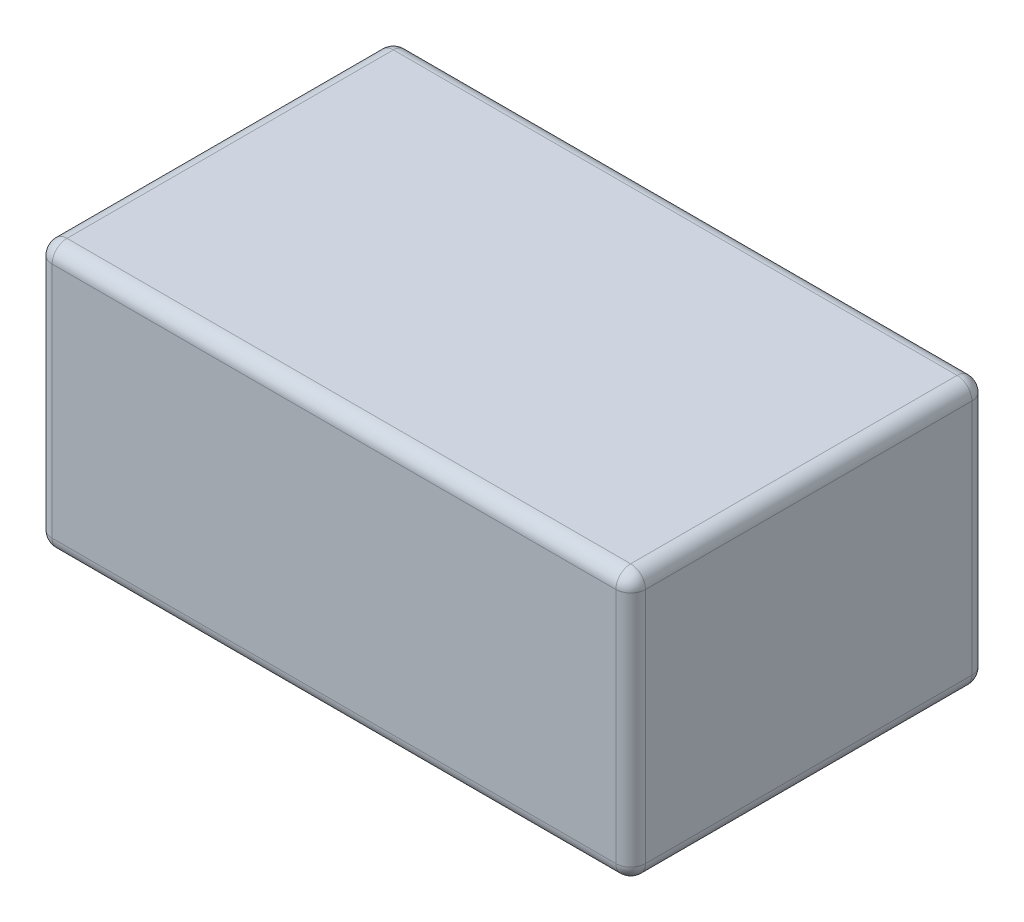
ISO-10303-21;
HEADER;
FILE_DESCRIPTION(('STEP AP214'),'2;1');
FILE_NAME('part.step','',(''),(''),'','','');
FILE_SCHEMA(('AUTOMOTIVE_DESIGN { 1 0 10303 214 1 1 1 1 }'));
ENDSEC;
DATA;
#1=APPLICATION_CONTEXT('core data for automotive mechanical design processes');
#2=APPLICATION_PROTOCOL_DEFINITION('international standard','automotive_design',2000,#1);
#3=PRODUCT_CONTEXT('',#1,'mechanical');
#4=PRODUCT('Part','Part','',(#3));
#5=PRODUCT_RELATED_PRODUCT_CATEGORY('part','',(#4));
#6=PRODUCT_DEFINITION_FORMATION('','',#4);
#7=PRODUCT_DEFINITION_CONTEXT('part definition',#1,'design');
#8=PRODUCT_DEFINITION('design','',#6,#7);
#9=PRODUCT_DEFINITION_SHAPE('','',#8);
#10=(LENGTH_UNIT() NAMED_UNIT(*) SI_UNIT(.MILLI.,.METRE.));
#11=(NAMED_UNIT(*) PLANE_ANGLE_UNIT() SI_UNIT($,.RADIAN.));
#12=(NAMED_UNIT(*) SI_UNIT($,.STERADIAN.) SOLID_ANGLE_UNIT());
#13=UNCERTAINTY_MEASURE_WITH_UNIT(LENGTH_MEASURE(1.E-05),#10,'distance_accuracy_value','');
#14=(GEOMETRIC_REPRESENTATION_CONTEXT(3) GLOBAL_UNCERTAINTY_ASSIGNED_CONTEXT((#13)) GLOBAL_UNIT_ASSIGNED_CONTEXT((#10,
#11,#12)) REPRESENTATION_CONTEXT('',''));
#15=CARTESIAN_POINT('',(0.,0.,0.));
#16=DIRECTION('',(0.,0.,1.));
#17=DIRECTION('',(1.,0.,0.));
#18=AXIS2_PLACEMENT_3D('',#15,#16,#17);
#19=CARTESIAN_POINT('',(0.95,0.05,0.55));
#20=DIRECTION('',(1.,0.,0.));
#21=DIRECTION('',(0.,0.,-1.));
#22=AXIS2_PLACEMENT_3D('',#19,#20,#21);
#23=SPHERICAL_SURFACE('',#22,0.05);
#24=CARTESIAN_POINT('',(0.95,0.05,0.55));
#25=DIRECTION('',(-1.,0.,0.));
#26=DIRECTION('',(0.,0.,1.));
#27=AXIS2_PLACEMENT_3D('',#24,#25,#26);
#28=CIRCLE('',#27,0.05);
#29=CARTESIAN_POINT('',(0.95,0.,0.55));
#30=VERTEX_POINT('',#29);
#31=CARTESIAN_POINT('',(0.95,0.050000000000024,0.6));
#32=VERTEX_POINT('',#31);
#33=EDGE_CURVE('E111',#30,#32,#28,.T.);
#34=ORIENTED_EDGE('',*,*,#33,.F.);
#35=CARTESIAN_POINT('',(0.95,0.05,0.55));
#36=DIRECTION('',(0.,0.,1.));
#37=DIRECTION('',(1.,0.,0.));
#38=AXIS2_PLACEMENT_3D('',#35,#36,#37);
#39=CIRCLE('',#38,0.05);
#40=CARTESIAN_POINT('',(1.,0.05,0.55));
#41=VERTEX_POINT('',#40);
#42=EDGE_CURVE('E122',#41,#30,#39,.F.);
#43=ORIENTED_EDGE('',*,*,#42,.F.);
#44=CARTESIAN_POINT('',(0.95,0.05,0.55));
#45=DIRECTION('',(0.,-1.,0.));
#46=DIRECTION('',(0.,0.,-1.));
#47=AXIS2_PLACEMENT_3D('',#44,#45,#46);
#48=CIRCLE('',#47,0.05);
#49=EDGE_CURVE('E131',#32,#41,#48,.F.);
#50=ORIENTED_EDGE('',*,*,#49,.F.);
#51=EDGE_LOOP('',(#34,#43,#50));
#52=FACE_BOUND('',#51,.T.);
#53=ADVANCED_FACE('F17',(#52),#23,.T.);
#54=CARTESIAN_POINT('',(-0.95,0.05,0.55));
#55=DIRECTION('',(1.,0.,0.));
#56=DIRECTION('',(0.,0.,-1.));
#57=AXIS2_PLACEMENT_3D('',#54,#55,#56);
#58=SPHERICAL_SURFACE('',#57,0.05);
#59=CARTESIAN_POINT('',(-0.95,0.05,0.55));
#60=DIRECTION('',(0.,-1.,0.));
#61=DIRECTION('',(0.,0.,-1.));
#62=AXIS2_PLACEMENT_3D('',#59,#60,#61);
#63=CIRCLE('',#62,0.05);
#64=CARTESIAN_POINT('',(-1.,0.05,0.55));
#65=VERTEX_POINT('',#64);
#66=CARTESIAN_POINT('',(-0.95,0.05,0.6));
#67=VERTEX_POINT('',#66);
#68=EDGE_CURVE('E261',#65,#67,#63,.F.);
#69=ORIENTED_EDGE('',*,*,#68,.F.);
#70=CARTESIAN_POINT('',(-0.95,0.05,0.55));
#71=DIRECTION('',(0.,0.,-1.));
#72=DIRECTION('',(-1.,0.,0.));
#73=AXIS2_PLACEMENT_3D('',#70,#71,#72);
#74=CIRCLE('',#73,0.05);
#75=CARTESIAN_POINT('',(-0.95,0.,0.549999999999904));
#76=VERTEX_POINT('',#75);
#77=EDGE_CURVE('E270',#76,#65,#74,.T.);
#78=ORIENTED_EDGE('',*,*,#77,.F.);
#79=CARTESIAN_POINT('',(-0.95,0.05,0.55));
#80=DIRECTION('',(-1.,0.,0.));
#81=DIRECTION('',(0.,0.,1.));
#82=AXIS2_PLACEMENT_3D('',#79,#80,#81);
#83=CIRCLE('',#82,0.05);
#84=EDGE_CURVE('E114',#67,#76,#83,.F.);
#85=ORIENTED_EDGE('',*,*,#84,.F.);
#86=EDGE_LOOP('',(#69,#78,#85));
#87=FACE_BOUND('',#86,.T.);
#88=ADVANCED_FACE('F151',(#87),#58,.T.);
#89=CARTESIAN_POINT('',(-0.95,0.05,-0.55));
#90=DIRECTION('',(1.,0.,0.));
#91=DIRECTION('',(0.,0.,-1.));
#92=AXIS2_PLACEMENT_3D('',#89,#90,#91);
#93=SPHERICAL_SURFACE('',#92,0.05);
#94=CARTESIAN_POINT('',(-0.95,0.05,-0.55));
#95=DIRECTION('',(0.,-1.,0.));
#96=DIRECTION('',(0.,0.,-1.));
#97=AXIS2_PLACEMENT_3D('',#94,#95,#96);
#98=CIRCLE('',#97,0.05);
#99=CARTESIAN_POINT('',(-0.95,0.05,-0.6));
#100=VERTEX_POINT('',#99);
#101=CARTESIAN_POINT('',(-1.,0.05,-0.55));
#102=VERTEX_POINT('',#101);
#103=EDGE_CURVE('E256',#100,#102,#98,.F.);
#104=ORIENTED_EDGE('',*,*,#103,.F.);
#105=CARTESIAN_POINT('',(-0.95,0.05,-0.55));
#106=DIRECTION('',(1.,0.,0.));
#107=DIRECTION('',(0.,0.,-1.));
#108=AXIS2_PLACEMENT_3D('',#105,#106,#107);
#109=CIRCLE('',#108,0.05);
#110=CARTESIAN_POINT('',(-0.95,0.,-0.55));
#111=VERTEX_POINT('',#110);
#112=EDGE_CURVE('E253',#111,#100,#109,.T.);
#113=ORIENTED_EDGE('',*,*,#112,.F.);
#114=CARTESIAN_POINT('',(-0.95,0.05,-0.55));
#115=DIRECTION('',(0.,0.,-1.));
#116=DIRECTION('',(-1.,0.,0.));
#117=AXIS2_PLACEMENT_3D('',#114,#115,#116);
#118=CIRCLE('',#117,0.05);
#119=EDGE_CURVE('E267',#102,#111,#118,.F.);
#120=ORIENTED_EDGE('',*,*,#119,.F.);
#121=EDGE_LOOP('',(#104,#113,#120));
#122=FACE_BOUND('',#121,.T.);
#123=ADVANCED_FACE('F147',(#122),#93,.T.);
#124=CARTESIAN_POINT('',(0.95,0.05,-0.55));
#125=DIRECTION('',(1.,0.,0.));
#126=DIRECTION('',(0.,0.,-1.));
#127=AXIS2_PLACEMENT_3D('',#124,#125,#126);
#128=SPHERICAL_SURFACE('',#127,0.05);
#129=CARTESIAN_POINT('',(0.95,0.05,-0.55));
#130=DIRECTION('',(1.,0.,0.));
#131=DIRECTION('',(0.,0.,-1.));
#132=AXIS2_PLACEMENT_3D('',#129,#130,#131);
#133=CIRCLE('',#132,0.05);
#134=CARTESIAN_POINT('',(0.95,0.05,-0.6));
#135=VERTEX_POINT('',#134);
#136=CARTESIAN_POINT('',(0.95,0.,-0.549999999999952));
#137=VERTEX_POINT('',#136);
#138=EDGE_CURVE('E251',#135,#137,#133,.F.);
#139=ORIENTED_EDGE('',*,*,#138,.F.);
#140=CARTESIAN_POINT('',(0.95,0.05,-0.55));
#141=DIRECTION('',(0.,-1.,0.));
#142=DIRECTION('',(0.,0.,-1.));
#143=AXIS2_PLACEMENT_3D('',#140,#141,#142);
#144=CIRCLE('',#143,0.05);
#145=CARTESIAN_POINT('',(1.,0.05,-0.55));
#146=VERTEX_POINT('',#145);
#147=EDGE_CURVE('E258',#146,#135,#144,.F.);
#148=ORIENTED_EDGE('',*,*,#147,.F.);
#149=CARTESIAN_POINT('',(0.95,0.05,-0.55));
#150=DIRECTION('',(0.,0.,1.));
#151=DIRECTION('',(1.,0.,0.));
#152=AXIS2_PLACEMENT_3D('',#149,#150,#151);
#153=CIRCLE('',#152,0.05);
#154=EDGE_CURVE('E133',#137,#146,#153,.T.);
#155=ORIENTED_EDGE('',*,*,#154,.F.);
#156=EDGE_LOOP('',(#139,#148,#155));
#157=FACE_BOUND('',#156,.T.);
#158=ADVANCED_FACE('F143',(#157),#128,.T.);
#159=CARTESIAN_POINT('',(0.95,0.05,0.6));
#160=DIRECTION('',(0.,0.,1.));
#161=DIRECTION('',(1.,0.,0.));
#162=AXIS2_PLACEMENT_3D('',#159,#160,#161);
#163=CYLINDRICAL_SURFACE('',#162,0.05);
#164=ORIENTED_EDGE('',*,*,#154,.T.);
#165=DIRECTION('',(0.,0.,1.));
#166=VECTOR('',#165,1.);
#167=CARTESIAN_POINT('',(1.,0.05,0.6));
#168=LINE('',#167,#166);
#169=EDGE_CURVE('E127',#146,#41,#168,.T.);
#170=ORIENTED_EDGE('',*,*,#169,.T.);
#171=ORIENTED_EDGE('',*,*,#42,.T.);
#172=DIRECTION('',(0.,0.,1.));
#173=VECTOR('',#172,1.);
#174=CARTESIAN_POINT('',(0.95,0.,0.6));
#175=LINE('',#174,#173);
#176=EDGE_CURVE('E124',#30,#137,#175,.F.);
#177=ORIENTED_EDGE('',*,*,#176,.T.);
#178=EDGE_LOOP('',(#164,#170,#171,#177));
#179=FACE_BOUND('',#178,.T.);
#180=ADVANCED_FACE('F123',(#179),#163,.T.);
#181=CARTESIAN_POINT('',(0.95,0.9,0.55));
#182=DIRECTION('',(0.,-1.,0.));
#183=DIRECTION('',(0.,0.,-1.));
#184=AXIS2_PLACEMENT_3D('',#181,#182,#183);
#185=CYLINDRICAL_SURFACE('',#184,0.05);
#186=ORIENTED_EDGE('',*,*,#49,.T.);
#187=DIRECTION('',(0.,1.,0.));
#188=VECTOR('',#187,1.);
#189=CARTESIAN_POINT('',(1.,0.9,0.55));
#190=LINE('',#189,#188);
#191=CARTESIAN_POINT('',(1.,0.85,0.55));
#192=VERTEX_POINT('',#191);
#193=EDGE_CURVE('E247',#41,#192,#190,.T.);
#194=ORIENTED_EDGE('',*,*,#193,.T.);
#195=CARTESIAN_POINT('',(0.95,0.85,0.55));
#196=DIRECTION('',(0.,-1.,0.));
#197=DIRECTION('',(1.,0.,0.));
#198=AXIS2_PLACEMENT_3D('',#195,#196,#197);
#199=CIRCLE('',#198,0.05);
#200=CARTESIAN_POINT('',(0.95,0.85,0.6));
#201=VERTEX_POINT('',#200);
#202=EDGE_CURVE('E242',#201,#192,#199,.F.);
#203=ORIENTED_EDGE('',*,*,#202,.F.);
#204=DIRECTION('',(0.,1.,0.));
#205=VECTOR('',#204,1.);
#206=CARTESIAN_POINT('',(0.95,0.9,0.6));
#207=LINE('',#206,#205);
#208=EDGE_CURVE('E116',#201,#32,#207,.F.);
#209=ORIENTED_EDGE('',*,*,#208,.T.);
#210=EDGE_LOOP('',(#186,#194,#203,#209));
#211=FACE_BOUND('',#210,.T.);
#212=ADVANCED_FACE('F274',(#211),#185,.T.);
#213=CARTESIAN_POINT('',(-0.95,0.05,0.6));
#214=DIRECTION('',(0.,0.,-1.));
#215=DIRECTION('',(-1.,0.,0.));
#216=AXIS2_PLACEMENT_3D('',#213,#214,#215);
#217=CYLINDRICAL_SURFACE('',#216,0.05);
#218=ORIENTED_EDGE('',*,*,#119,.T.);
#219=DIRECTION('',(0.,0.,-1.));
#220=VECTOR('',#219,1.);
#221=CARTESIAN_POINT('',(-0.95,0.,0.6));
#222=LINE('',#221,#220);
#223=EDGE_CURVE('E264',#111,#76,#222,.F.);
#224=ORIENTED_EDGE('',*,*,#223,.T.);
#225=ORIENTED_EDGE('',*,*,#77,.T.);
#226=DIRECTION('',(0.,0.,-1.));
#227=VECTOR('',#226,1.);
#228=CARTESIAN_POINT('',(-1.,0.05,0.6));
#229=LINE('',#228,#227);
#230=EDGE_CURVE('E220',#65,#102,#229,.T.);
#231=ORIENTED_EDGE('',*,*,#230,.T.);
#232=EDGE_LOOP('',(#218,#224,#225,#231));
#233=FACE_BOUND('',#232,.T.);
#234=ADVANCED_FACE('F361',(#233),#217,.T.);
#235=CARTESIAN_POINT('',(-0.95,0.9,0.55));
#236=DIRECTION('',(0.,-1.,0.));
#237=DIRECTION('',(0.,0.,-1.));
#238=AXIS2_PLACEMENT_3D('',#235,#236,#237);
#239=CYLINDRICAL_SURFACE('',#238,0.05);
#240=ORIENTED_EDGE('',*,*,#68,.T.);
#241=DIRECTION('',(0.,1.,0.));
#242=VECTOR('',#241,1.);
#243=CARTESIAN_POINT('',(-0.95,0.9,0.6));
#244=LINE('',#243,#242);
#245=CARTESIAN_POINT('',(-0.95,0.849999999999952,0.6));
#246=VERTEX_POINT('',#245);
#247=EDGE_CURVE('E241',#67,#246,#244,.T.);
#248=ORIENTED_EDGE('',*,*,#247,.T.);
#249=CARTESIAN_POINT('',(-0.95,0.85,0.55));
#250=DIRECTION('',(0.,-1.,-7.66574547575187E-12));
#251=DIRECTION('',(1.,0.,0.));
#252=AXIS2_PLACEMENT_3D('',#249,#250,#251);
#253=CIRCLE('',#252,0.05);
#254=CARTESIAN_POINT('',(-1.,0.85,0.55));
#255=VERTEX_POINT('',#254);
#256=EDGE_CURVE('E223',#255,#246,#253,.F.);
#257=ORIENTED_EDGE('',*,*,#256,.F.);
#258=DIRECTION('',(0.,1.,0.));
#259=VECTOR('',#258,1.);
#260=CARTESIAN_POINT('',(-1.,0.9,0.55));
#261=LINE('',#260,#259);
#262=EDGE_CURVE('E214',#255,#65,#261,.F.);
#263=ORIENTED_EDGE('',*,*,#262,.T.);
#264=EDGE_LOOP('',(#240,#248,#257,#263));
#265=FACE_BOUND('',#264,.T.);
#266=ADVANCED_FACE('F359',(#265),#239,.T.);
#267=CARTESIAN_POINT('',(0.95,0.9,-0.55));
#268=DIRECTION('',(0.,-1.,0.));
#269=DIRECTION('',(0.,0.,-1.));
#270=AXIS2_PLACEMENT_3D('',#267,#268,#269);
#271=CYLINDRICAL_SURFACE('',#270,0.05);
#272=ORIENTED_EDGE('',*,*,#147,.T.);
#273=DIRECTION('',(0.,1.,0.));
#274=VECTOR('',#273,1.);
#275=CARTESIAN_POINT('',(0.95,0.9,-0.6));
#276=LINE('',#275,#274);
#277=CARTESIAN_POINT('',(0.95,0.85,-0.6));
#278=VERTEX_POINT('',#277);
#279=EDGE_CURVE('E206',#135,#278,#276,.T.);
#280=ORIENTED_EDGE('',*,*,#279,.T.);
#281=CARTESIAN_POINT('',(0.95,0.85,-0.55));
#282=DIRECTION('',(0.,1.,0.));
#283=DIRECTION('',(1.,0.,0.));
#284=AXIS2_PLACEMENT_3D('',#281,#282,#283);
#285=CIRCLE('',#284,0.05);
#286=CARTESIAN_POINT('',(1.,0.85,-0.55));
#287=VERTEX_POINT('',#286);
#288=EDGE_CURVE('E208',#287,#278,#285,.T.);
#289=ORIENTED_EDGE('',*,*,#288,.F.);
#290=DIRECTION('',(0.,1.,0.));
#291=VECTOR('',#290,1.);
#292=CARTESIAN_POINT('',(1.,0.9,-0.55));
#293=LINE('',#292,#291);
#294=EDGE_CURVE('E117',#287,#146,#293,.F.);
#295=ORIENTED_EDGE('',*,*,#294,.T.);
#296=EDGE_LOOP('',(#272,#280,#289,#295));
#297=FACE_BOUND('',#296,.T.);
#298=ADVANCED_FACE('F310',(#297),#271,.T.);
#299=CARTESIAN_POINT('',(-0.95,0.9,-0.55));
#300=DIRECTION('',(0.,-1.,0.));
#301=DIRECTION('',(0.,0.,-1.));
#302=AXIS2_PLACEMENT_3D('',#299,#300,#301);
#303=CYLINDRICAL_SURFACE('',#302,0.05);
#304=CARTESIAN_POINT('',(-0.95,0.85,-0.55));
#305=DIRECTION('',(0.,1.,0.));
#306=DIRECTION('',(1.,0.,0.));
#307=AXIS2_PLACEMENT_3D('',#304,#305,#306);
#308=CIRCLE('',#307,0.05);
#309=CARTESIAN_POINT('',(-0.95,0.85,-0.6));
#310=VERTEX_POINT('',#309);
#311=CARTESIAN_POINT('',(-1.,0.85,-0.55));
#312=VERTEX_POINT('',#311);
#313=EDGE_CURVE('E210',#310,#312,#308,.T.);
#314=ORIENTED_EDGE('',*,*,#313,.F.);
#315=DIRECTION('',(0.,1.,0.));
#316=VECTOR('',#315,1.);
#317=CARTESIAN_POINT('',(-0.95,0.9,-0.6));
#318=LINE('',#317,#316);
#319=EDGE_CURVE('E300',#310,#100,#318,.F.);
#320=ORIENTED_EDGE('',*,*,#319,.T.);
#321=ORIENTED_EDGE('',*,*,#103,.T.);
#322=DIRECTION('',(0.,1.,0.));
#323=VECTOR('',#322,1.);
#324=CARTESIAN_POINT('',(-1.,0.9,-0.55));
#325=LINE('',#324,#323);
#326=EDGE_CURVE('E217',#102,#312,#325,.T.);
#327=ORIENTED_EDGE('',*,*,#326,.T.);
#328=EDGE_LOOP('',(#314,#320,#321,#327));
#329=FACE_BOUND('',#328,.T.);
#330=ADVANCED_FACE('F351',(#329),#303,.T.);
#331=CARTESIAN_POINT('',(1.,0.,-0.6));
#332=DIRECTION('',(0.,-1.,0.));
#333=DIRECTION('',(0.,0.,-1.));
#334=AXIS2_PLACEMENT_3D('',#331,#332,#333);
#335=PLANE('',#334);
#336=DIRECTION('',(1.,0.,0.));
#337=VECTOR('',#336,1.);
#338=CARTESIAN_POINT('',(-1.,0.,-0.55));
#339=LINE('',#338,#337);
#340=EDGE_CURVE('E101',#137,#111,#339,.F.);
#341=ORIENTED_EDGE('',*,*,#340,.F.);
#342=ORIENTED_EDGE('',*,*,#176,.F.);
#343=DIRECTION('',(-1.,0.,0.));
#344=VECTOR('',#343,1.);
#345=CARTESIAN_POINT('',(-1.,0.,0.55));
#346=LINE('',#345,#344);
#347=EDGE_CURVE('E107',#76,#30,#346,.F.);
#348=ORIENTED_EDGE('',*,*,#347,.F.);
#349=ORIENTED_EDGE('',*,*,#223,.F.);
#350=EDGE_LOOP('',(#341,#342,#348,#349));
#351=FACE_BOUND('',#350,.T.);
#352=ADVANCED_FACE('F135',(#351),#335,.T.);
#353=CARTESIAN_POINT('',(1.,0.9,0.6));
#354=DIRECTION('',(-1.,0.,0.));
#355=DIRECTION('',(0.,0.,1.));
#356=AXIS2_PLACEMENT_3D('',#353,#354,#355);
#357=PLANE('',#356);
#358=DIRECTION('',(0.,0.,-1.));
#359=VECTOR('',#358,1.);
#360=CARTESIAN_POINT('',(1.,0.85,-0.6));
#361=LINE('',#360,#359);
#362=EDGE_CURVE('E291',#192,#287,#361,.T.);
#363=ORIENTED_EDGE('',*,*,#362,.F.);
#364=ORIENTED_EDGE('',*,*,#193,.F.);
#365=ORIENTED_EDGE('',*,*,#169,.F.);
#366=ORIENTED_EDGE('',*,*,#294,.F.);
#367=EDGE_LOOP('',(#363,#364,#365,#366));
#368=FACE_BOUND('',#367,.T.);
#369=ADVANCED_FACE('F346',(#368),#357,.F.);
#370=CARTESIAN_POINT('',(-1.,0.05,0.55));
#371=DIRECTION('',(-1.,0.,0.));
#372=DIRECTION('',(0.,0.,1.));
#373=AXIS2_PLACEMENT_3D('',#370,#371,#372);
#374=CYLINDRICAL_SURFACE('',#373,0.05);
#375=ORIENTED_EDGE('',*,*,#347,.T.);
#376=ORIENTED_EDGE('',*,*,#33,.T.);
#377=DIRECTION('',(-1.,0.,0.));
#378=VECTOR('',#377,1.);
#379=CARTESIAN_POINT('',(-1.,0.05,0.6));
#380=LINE('',#379,#378);
#381=EDGE_CURVE('E282',#32,#67,#380,.T.);
#382=ORIENTED_EDGE('',*,*,#381,.T.);
#383=ORIENTED_EDGE('',*,*,#84,.T.);
#384=EDGE_LOOP('',(#375,#376,#382,#383));
#385=FACE_BOUND('',#384,.T.);
#386=ADVANCED_FACE('F109',(#385),#374,.T.);
#387=CARTESIAN_POINT('',(0.95,0.85,0.55));
#388=DIRECTION('',(1.,0.,0.));
#389=DIRECTION('',(0.,0.,-1.));
#390=AXIS2_PLACEMENT_3D('',#387,#388,#389);
#391=SPHERICAL_SURFACE('',#390,0.05);
#392=ORIENTED_EDGE('',*,*,#202,.T.);
#393=CARTESIAN_POINT('',(0.95,0.85,0.55));
#394=DIRECTION('',(0.,0.,-1.));
#395=DIRECTION('',(-1.,0.,0.));
#396=AXIS2_PLACEMENT_3D('',#393,#394,#395);
#397=CIRCLE('',#396,0.05);
#398=CARTESIAN_POINT('',(0.95,0.9,0.549999999999808));
#399=VERTEX_POINT('',#398);
#400=EDGE_CURVE('E297',#399,#192,#397,.T.);
#401=ORIENTED_EDGE('',*,*,#400,.F.);
#402=CARTESIAN_POINT('',(0.95,0.85,0.55));
#403=DIRECTION('',(1.,0.,0.));
#404=DIRECTION('',(0.,0.,-1.));
#405=AXIS2_PLACEMENT_3D('',#402,#403,#404);
#406=CIRCLE('',#405,0.05);
#407=EDGE_CURVE('E284',#201,#399,#406,.F.);
#408=ORIENTED_EDGE('',*,*,#407,.F.);
#409=EDGE_LOOP('',(#392,#401,#408));
#410=FACE_BOUND('',#409,.T.);
#411=ADVANCED_FACE('F232',(#410),#391,.T.);
#412=CARTESIAN_POINT('',(-0.95,0.85,0.55));
#413=DIRECTION('',(1.,0.,0.));
#414=DIRECTION('',(0.,0.,-1.));
#415=AXIS2_PLACEMENT_3D('',#412,#413,#414);
#416=SPHERICAL_SURFACE('',#415,0.05);
#417=ORIENTED_EDGE('',*,*,#256,.T.);
#418=CARTESIAN_POINT('',(-0.95,0.85,0.55));
#419=DIRECTION('',(1.,0.,0.));
#420=DIRECTION('',(0.,0.,-1.));
#421=AXIS2_PLACEMENT_3D('',#418,#419,#420);
#422=CIRCLE('',#421,0.05);
#423=CARTESIAN_POINT('',(-0.95,0.9,0.55));
#424=VERTEX_POINT('',#423);
#425=EDGE_CURVE('E288',#424,#246,#422,.T.);
#426=ORIENTED_EDGE('',*,*,#425,.F.);
#427=CARTESIAN_POINT('',(-0.95,0.85,0.55));
#428=DIRECTION('',(0.,0.,1.));
#429=DIRECTION('',(1.,0.,0.));
#430=AXIS2_PLACEMENT_3D('',#427,#428,#429);
#431=CIRCLE('',#430,0.05);
#432=EDGE_CURVE('E331',#255,#424,#431,.F.);
#433=ORIENTED_EDGE('',*,*,#432,.F.);
#434=EDGE_LOOP('',(#417,#426,#433));
#435=FACE_BOUND('',#434,.T.);
#436=ADVANCED_FACE('F228',(#435),#416,.T.);
#437=CARTESIAN_POINT('',(-1.,0.9,0.6));
#438=DIRECTION('',(1.,0.,0.));
#439=DIRECTION('',(0.,0.,-1.));
#440=AXIS2_PLACEMENT_3D('',#437,#438,#439);
#441=PLANE('',#440);
#442=DIRECTION('',(0.,0.,1.));
#443=VECTOR('',#442,1.);
#444=CARTESIAN_POINT('',(-1.,0.85,-0.6));
#445=LINE('',#444,#443);
#446=EDGE_CURVE('E322',#312,#255,#445,.T.);
#447=ORIENTED_EDGE('',*,*,#446,.F.);
#448=ORIENTED_EDGE('',*,*,#326,.F.);
#449=ORIENTED_EDGE('',*,*,#230,.F.);
#450=ORIENTED_EDGE('',*,*,#262,.F.);
#451=EDGE_LOOP('',(#447,#448,#449,#450));
#452=FACE_BOUND('',#451,.T.);
#453=ADVANCED_FACE('F231',(#452),#441,.F.);
#454=CARTESIAN_POINT('',(-0.95,0.85,-0.55));
#455=DIRECTION('',(1.,0.,0.));
#456=DIRECTION('',(0.,0.,-1.));
#457=AXIS2_PLACEMENT_3D('',#454,#455,#456);
#458=SPHERICAL_SURFACE('',#457,0.05);
#459=CARTESIAN_POINT('',(-0.95,0.85,-0.55));
#460=DIRECTION('',(0.,0.,1.));
#461=DIRECTION('',(1.,0.,0.));
#462=AXIS2_PLACEMENT_3D('',#459,#460,#461);
#463=CIRCLE('',#462,0.05);
#464=CARTESIAN_POINT('',(-0.95,0.9,-0.549999999999808));
#465=VERTEX_POINT('',#464);
#466=EDGE_CURVE('E328',#465,#312,#463,.T.);
#467=ORIENTED_EDGE('',*,*,#466,.F.);
#468=CARTESIAN_POINT('',(-0.95,0.85,-0.55));
#469=DIRECTION('',(-1.,0.,0.));
#470=DIRECTION('',(0.,0.,1.));
#471=AXIS2_PLACEMENT_3D('',#468,#469,#470);
#472=CIRCLE('',#471,0.05);
#473=EDGE_CURVE('E318',#310,#465,#472,.F.);
#474=ORIENTED_EDGE('',*,*,#473,.F.);
#475=ORIENTED_EDGE('',*,*,#313,.T.);
#476=EDGE_LOOP('',(#467,#474,#475));
#477=FACE_BOUND('',#476,.T.);
#478=ADVANCED_FACE('F199',(#477),#458,.T.);
#479=CARTESIAN_POINT('',(0.95,0.85,-0.55));
#480=DIRECTION('',(1.,0.,0.));
#481=DIRECTION('',(0.,0.,-1.));
#482=AXIS2_PLACEMENT_3D('',#479,#480,#481);
#483=SPHERICAL_SURFACE('',#482,0.05);
#484=CARTESIAN_POINT('',(0.95,0.85,-0.55));
#485=DIRECTION('',(0.,0.,-1.));
#486=DIRECTION('',(-1.,0.,0.));
#487=AXIS2_PLACEMENT_3D('',#484,#485,#486);
#488=CIRCLE('',#487,0.05);
#489=CARTESIAN_POINT('',(0.95,0.9,-0.55));
#490=VERTEX_POINT('',#489);
#491=EDGE_CURVE('E285',#287,#490,#488,.F.);
#492=ORIENTED_EDGE('',*,*,#491,.F.);
#493=ORIENTED_EDGE('',*,*,#288,.T.);
#494=CARTESIAN_POINT('',(0.95,0.85,-0.55));
#495=DIRECTION('',(-1.,0.,0.));
#496=DIRECTION('',(0.,0.,1.));
#497=AXIS2_PLACEMENT_3D('',#494,#495,#496);
#498=CIRCLE('',#497,0.05);
#499=EDGE_CURVE('E315',#490,#278,#498,.T.);
#500=ORIENTED_EDGE('',*,*,#499,.F.);
#501=EDGE_LOOP('',(#492,#493,#500));
#502=FACE_BOUND('',#501,.T.);
#503=ADVANCED_FACE('F194',(#502),#483,.T.);
#504=CARTESIAN_POINT('',(-1.,0.05,-0.55));
#505=DIRECTION('',(1.,0.,0.));
#506=DIRECTION('',(0.,0.,-1.));
#507=AXIS2_PLACEMENT_3D('',#504,#505,#506);
#508=CYLINDRICAL_SURFACE('',#507,0.05);
#509=DIRECTION('',(1.,0.,0.));
#510=VECTOR('',#509,1.);
#511=CARTESIAN_POINT('',(-1.,0.05,-0.6));
#512=LINE('',#511,#510);
#513=EDGE_CURVE('E317',#100,#135,#512,.T.);
#514=ORIENTED_EDGE('',*,*,#513,.T.);
#515=ORIENTED_EDGE('',*,*,#138,.T.);
#516=ORIENTED_EDGE('',*,*,#340,.T.);
#517=ORIENTED_EDGE('',*,*,#112,.T.);
#518=EDGE_LOOP('',(#514,#515,#516,#517));
#519=FACE_BOUND('',#518,.T.);
#520=ADVANCED_FACE('F190',(#519),#508,.T.);
#521=CARTESIAN_POINT('',(0.95,0.85,-0.6));
#522=DIRECTION('',(0.,0.,-1.));
#523=DIRECTION('',(-1.,0.,0.));
#524=AXIS2_PLACEMENT_3D('',#521,#522,#523);
#525=CYLINDRICAL_SURFACE('',#524,0.05);
#526=ORIENTED_EDGE('',*,*,#491,.T.);
#527=DIRECTION('',(0.,0.,-1.));
#528=VECTOR('',#527,1.);
#529=CARTESIAN_POINT('',(0.95,0.9,-0.6));
#530=LINE('',#529,#528);
#531=EDGE_CURVE('E320',#490,#399,#530,.F.);
#532=ORIENTED_EDGE('',*,*,#531,.T.);
#533=ORIENTED_EDGE('',*,*,#400,.T.);
#534=ORIENTED_EDGE('',*,*,#362,.T.);
#535=EDGE_LOOP('',(#526,#532,#533,#534));
#536=FACE_BOUND('',#535,.T.);
#537=ADVANCED_FACE('F186',(#536),#525,.T.);
#538=CARTESIAN_POINT('',(-1.,0.9,0.6));
#539=DIRECTION('',(0.,0.,-1.));
#540=DIRECTION('',(-1.,0.,0.));
#541=AXIS2_PLACEMENT_3D('',#538,#539,#540);
#542=PLANE('',#541);
#543=DIRECTION('',(1.,0.,0.));
#544=VECTOR('',#543,1.);
#545=CARTESIAN_POINT('',(1.,0.85,0.6));
#546=LINE('',#545,#544);
#547=EDGE_CURVE('E280',#246,#201,#546,.T.);
#548=ORIENTED_EDGE('',*,*,#547,.F.);
#549=ORIENTED_EDGE('',*,*,#247,.F.);
#550=ORIENTED_EDGE('',*,*,#381,.F.);
#551=ORIENTED_EDGE('',*,*,#208,.F.);
#552=EDGE_LOOP('',(#548,#549,#550,#551));
#553=FACE_BOUND('',#552,.T.);
#554=ADVANCED_FACE('F182',(#553),#542,.F.);
#555=CARTESIAN_POINT('',(-0.95,0.85,-0.6));
#556=DIRECTION('',(0.,0.,1.));
#557=DIRECTION('',(1.,0.,0.));
#558=AXIS2_PLACEMENT_3D('',#555,#556,#557);
#559=CYLINDRICAL_SURFACE('',#558,0.05);
#560=ORIENTED_EDGE('',*,*,#466,.T.);
#561=ORIENTED_EDGE('',*,*,#446,.T.);
#562=ORIENTED_EDGE('',*,*,#432,.T.);
#563=DIRECTION('',(0.,0.,-1.));
#564=VECTOR('',#563,1.);
#565=CARTESIAN_POINT('',(-0.95,0.9,-0.6));
#566=LINE('',#565,#564);
#567=EDGE_CURVE('E338',#424,#465,#566,.T.);
#568=ORIENTED_EDGE('',*,*,#567,.T.);
#569=EDGE_LOOP('',(#560,#561,#562,#568));
#570=FACE_BOUND('',#569,.T.);
#571=ADVANCED_FACE('F178',(#570),#559,.T.);
#572=CARTESIAN_POINT('',(-1.,0.9,-0.6));
#573=DIRECTION('',(0.,0.,1.));
#574=DIRECTION('',(1.,0.,0.));
#575=AXIS2_PLACEMENT_3D('',#572,#573,#574);
#576=PLANE('',#575);
#577=ORIENTED_EDGE('',*,*,#513,.F.);
#578=ORIENTED_EDGE('',*,*,#319,.F.);
#579=DIRECTION('',(-1.,0.,0.));
#580=VECTOR('',#579,1.);
#581=CARTESIAN_POINT('',(1.,0.85,-0.6));
#582=LINE('',#581,#580);
#583=EDGE_CURVE('E316',#278,#310,#582,.T.);
#584=ORIENTED_EDGE('',*,*,#583,.F.);
#585=ORIENTED_EDGE('',*,*,#279,.F.);
#586=EDGE_LOOP('',(#577,#578,#584,#585));
#587=FACE_BOUND('',#586,.T.);
#588=ADVANCED_FACE('F174',(#587),#576,.F.);
#589=CARTESIAN_POINT('',(1.,0.85,0.55));
#590=DIRECTION('',(1.,0.,0.));
#591=DIRECTION('',(0.,0.,-1.));
#592=AXIS2_PLACEMENT_3D('',#589,#590,#591);
#593=CYLINDRICAL_SURFACE('',#592,0.05);
#594=ORIENTED_EDGE('',*,*,#547,.T.);
#595=ORIENTED_EDGE('',*,*,#407,.T.);
#596=DIRECTION('',(1.,0.,0.));
#597=VECTOR('',#596,1.);
#598=CARTESIAN_POINT('',(1.,0.9,0.55));
#599=LINE('',#598,#597);
#600=EDGE_CURVE('E26',#399,#424,#599,.F.);
#601=ORIENTED_EDGE('',*,*,#600,.T.);
#602=ORIENTED_EDGE('',*,*,#425,.T.);
#603=EDGE_LOOP('',(#594,#595,#601,#602));
#604=FACE_BOUND('',#603,.T.);
#605=ADVANCED_FACE('F168',(#604),#593,.T.);
#606=CARTESIAN_POINT('',(1.,0.85,-0.55));
#607=DIRECTION('',(-1.,0.,0.));
#608=DIRECTION('',(0.,0.,1.));
#609=AXIS2_PLACEMENT_3D('',#606,#607,#608);
#610=CYLINDRICAL_SURFACE('',#609,0.05);
#611=DIRECTION('',(1.,0.,0.));
#612=VECTOR('',#611,1.);
#613=CARTESIAN_POINT('',(1.,0.9,-0.55));
#614=LINE('',#613,#612);
#615=EDGE_CURVE('E11',#465,#490,#614,.T.);
#616=ORIENTED_EDGE('',*,*,#615,.T.);
#617=ORIENTED_EDGE('',*,*,#499,.T.);
#618=ORIENTED_EDGE('',*,*,#583,.T.);
#619=ORIENTED_EDGE('',*,*,#473,.T.);
#620=EDGE_LOOP('',(#616,#617,#618,#619));
#621=FACE_BOUND('',#620,.T.);
#622=ADVANCED_FACE('F163',(#621),#610,.T.);
#623=CARTESIAN_POINT('',(1.,0.9,-0.6));
#624=DIRECTION('',(0.,-1.,0.));
#625=DIRECTION('',(0.,0.,-1.));
#626=AXIS2_PLACEMENT_3D('',#623,#624,#625);
#627=PLANE('',#626);
#628=ORIENTED_EDGE('',*,*,#615,.F.);
#629=ORIENTED_EDGE('',*,*,#567,.F.);
#630=ORIENTED_EDGE('',*,*,#600,.F.);
#631=ORIENTED_EDGE('',*,*,#531,.F.);
#632=EDGE_LOOP('',(#628,#629,#630,#631));
#633=FACE_BOUND('',#632,.T.);
#634=ADVANCED_FACE('F161',(#633),#627,.F.);
#635=CLOSED_SHELL('',(#53,#88,#123,#158,#180,#212,#234,#266,#298,#330,#352,#369,#386,#411,#436,
#453,#478,#503,#520,#537,#554,#571,#588,#605,#622,#634));
#636=MANIFOLD_SOLID_BREP('B1',#635);
#637=ADVANCED_BREP_SHAPE_REPRESENTATION('',(#18,#636),#14);
#638=SHAPE_DEFINITION_REPRESENTATION(#9,#637);
ENDSEC;
END-ISO-10303-21;
